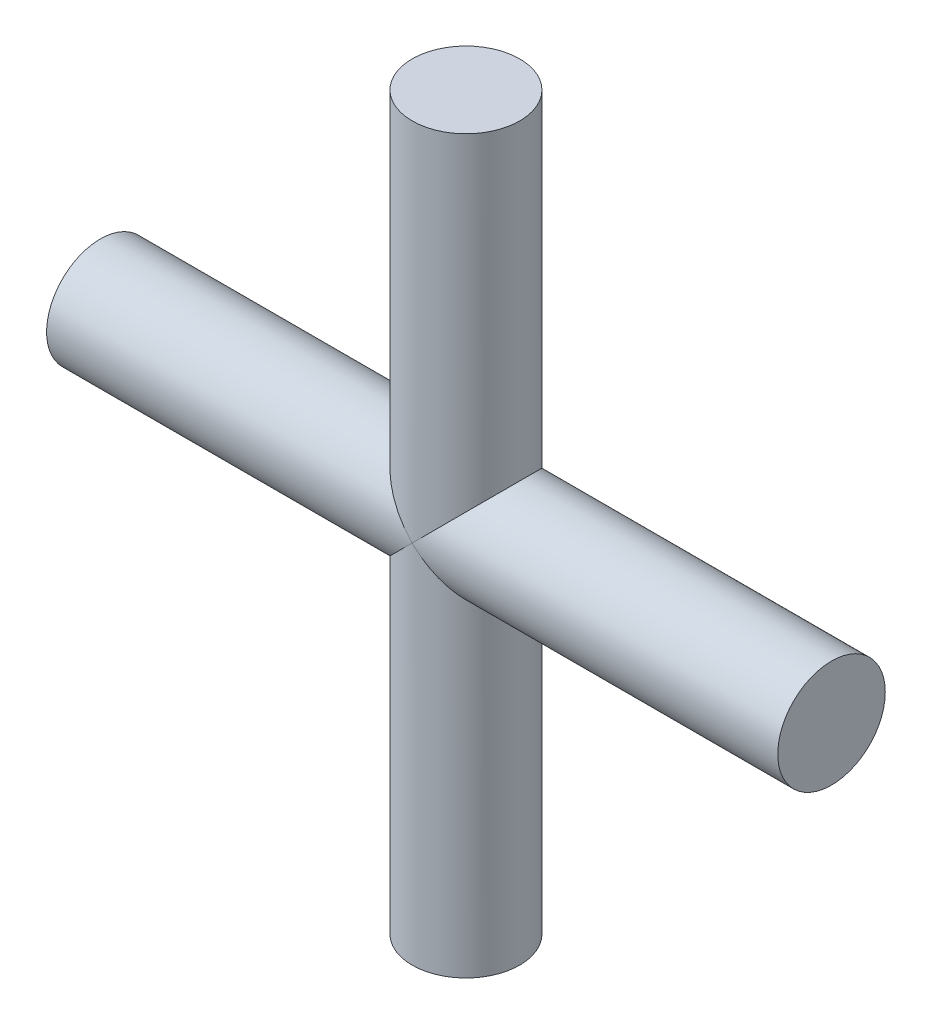
ISO-10303-21;
HEADER;
FILE_DESCRIPTION(('STEP AP214'),'2;1');
FILE_NAME('part.step','',(''),(''),'','','');
FILE_SCHEMA(('AUTOMOTIVE_DESIGN { 1 0 10303 214 1 1 1 1 }'));
ENDSEC;
DATA;
#1=APPLICATION_CONTEXT('core data for automotive mechanical design processes');
#2=APPLICATION_PROTOCOL_DEFINITION('international standard','automotive_design',2000,#1);
#3=PRODUCT_CONTEXT('',#1,'mechanical');
#4=PRODUCT('Part','Part','',(#3));
#5=PRODUCT_RELATED_PRODUCT_CATEGORY('part','',(#4));
#6=PRODUCT_DEFINITION_FORMATION('','',#4);
#7=PRODUCT_DEFINITION_CONTEXT('part definition',#1,'design');
#8=PRODUCT_DEFINITION('design','',#6,#7);
#9=PRODUCT_DEFINITION_SHAPE('','',#8);
#10=(LENGTH_UNIT() NAMED_UNIT(*) SI_UNIT(.MILLI.,.METRE.));
#11=(NAMED_UNIT(*) PLANE_ANGLE_UNIT() SI_UNIT($,.RADIAN.));
#12=(NAMED_UNIT(*) SI_UNIT($,.STERADIAN.) SOLID_ANGLE_UNIT());
#13=UNCERTAINTY_MEASURE_WITH_UNIT(LENGTH_MEASURE(1.E-05),#10,'distance_accuracy_value','');
#14=(GEOMETRIC_REPRESENTATION_CONTEXT(3) GLOBAL_UNCERTAINTY_ASSIGNED_CONTEXT((#13)) GLOBAL_UNIT_ASSIGNED_CONTEXT((#10,
#11,#12)) REPRESENTATION_CONTEXT('',''));
#15=CARTESIAN_POINT('',(0.,0.,0.));
#16=DIRECTION('',(0.,0.,1.));
#17=DIRECTION('',(1.,0.,0.));
#18=AXIS2_PLACEMENT_3D('',#15,#16,#17);
#19=CARTESIAN_POINT('',(0.,34.,0.));
#20=DIRECTION('',(0.,-1.,0.));
#21=DIRECTION('',(0.,0.,-1.));
#22=AXIS2_PLACEMENT_3D('',#19,#20,#21);
#23=CYLINDRICAL_SURFACE('',#22,2.5);
#24=CARTESIAN_POINT('',(0.,34.,0.));
#25=DIRECTION('',(0.,1.,0.));
#26=DIRECTION('',(0.,0.,1.));
#27=AXIS2_PLACEMENT_3D('',#24,#25,#26);
#28=CIRCLE('',#27,2.5);
#29=CARTESIAN_POINT('',(0.,34.,2.5));
#30=VERTEX_POINT('',#29);
#31=EDGE_CURVE('E62',#30,#30,#28,.T.);
#32=ORIENTED_EDGE('',*,*,#31,.F.);
#33=EDGE_LOOP('',(#32));
#34=FACE_BOUND('',#33,.T.);
#35=CARTESIAN_POINT('',(0.,17.,0.));
#36=DIRECTION('',(-0.707106781186547,-0.707106781186547,0.));
#37=DIRECTION('',(0.707106781186547,-0.707106781186547,0.));
#38=AXIS2_PLACEMENT_3D('',#35,#36,#37);
#39=ELLIPSE('',#38,3.53553390593274,2.5);
#40=CARTESIAN_POINT('',(0.,17.,2.5));
#41=VERTEX_POINT('',#40);
#42=CARTESIAN_POINT('',(0.,17.,-2.5));
#43=VERTEX_POINT('',#42);
#44=EDGE_CURVE('E46',#41,#43,#39,.T.);
#45=ORIENTED_EDGE('',*,*,#44,.F.);
#46=CARTESIAN_POINT('',(0.,17.,0.));
#47=DIRECTION('',(0.707106781186547,-0.707106781186547,0.));
#48=DIRECTION('',(-0.707106781186547,-0.707106781186547,0.));
#49=AXIS2_PLACEMENT_3D('',#46,#47,#48);
#50=ELLIPSE('',#49,3.53553390593274,2.5);
#51=EDGE_CURVE('E58',#43,#41,#50,.T.);
#52=ORIENTED_EDGE('',*,*,#51,.F.);
#53=EDGE_LOOP('',(#45,#52));
#54=FACE_BOUND('',#53,.T.);
#55=ADVANCED_FACE('F38',(#34,#54),#23,.T.);
#56=CARTESIAN_POINT('',(0.,34.,0.));
#57=DIRECTION('',(0.,1.,0.));
#58=DIRECTION('',(0.,0.,1.));
#59=AXIS2_PLACEMENT_3D('',#56,#57,#58);
#60=PLANE('',#59);
#61=ORIENTED_EDGE('',*,*,#31,.T.);
#62=EDGE_LOOP('',(#61));
#63=FACE_BOUND('',#62,.T.);
#64=ADVANCED_FACE('F85',(#63),#60,.T.);
#65=CARTESIAN_POINT('',(-17.,17.,0.));
#66=DIRECTION('',(1.,0.,0.));
#67=DIRECTION('',(0.,0.,-1.));
#68=AXIS2_PLACEMENT_3D('',#65,#66,#67);
#69=PLANE('',#68);
#70=CARTESIAN_POINT('',(-17.,17.,0.));
#71=DIRECTION('',(1.,0.,0.));
#72=DIRECTION('',(0.,0.,-1.));
#73=AXIS2_PLACEMENT_3D('',#70,#71,#72);
#74=CIRCLE('',#73,2.5);
#75=CARTESIAN_POINT('',(-17.,17.,-2.5));
#76=VERTEX_POINT('',#75);
#77=EDGE_CURVE('E99',#76,#76,#74,.T.);
#78=ORIENTED_EDGE('',*,*,#77,.F.);
#79=EDGE_LOOP('',(#78));
#80=FACE_BOUND('',#79,.T.);
#81=ADVANCED_FACE('F82',(#80),#69,.F.);
#82=CARTESIAN_POINT('',(17.,17.,0.));
#83=DIRECTION('',(-1.,0.,0.));
#84=DIRECTION('',(0.,0.,1.));
#85=AXIS2_PLACEMENT_3D('',#82,#83,#84);
#86=CYLINDRICAL_SURFACE('',#85,2.5);
#87=ORIENTED_EDGE('',*,*,#77,.T.);
#88=EDGE_LOOP('',(#87));
#89=FACE_BOUND('',#88,.T.);
#90=CARTESIAN_POINT('',(0.,17.,0.));
#91=DIRECTION('',(0.707106781186547,-0.707106781186547,0.));
#92=DIRECTION('',(-0.707106781186547,-0.707106781186547,0.));
#93=AXIS2_PLACEMENT_3D('',#90,#91,#92);
#94=ELLIPSE('',#93,3.53553390593274,2.5);
#95=EDGE_CURVE('E52',#43,#41,#94,.F.);
#96=ORIENTED_EDGE('',*,*,#95,.T.);
#97=ORIENTED_EDGE('',*,*,#44,.T.);
#98=EDGE_LOOP('',(#96,#97));
#99=FACE_BOUND('',#98,.T.);
#100=ADVANCED_FACE('F64',(#89,#99),#86,.T.);
#101=CARTESIAN_POINT('',(0.,0.,0.));
#102=DIRECTION('',(0.,1.,0.));
#103=DIRECTION('',(0.,0.,1.));
#104=AXIS2_PLACEMENT_3D('',#101,#102,#103);
#105=PLANE('',#104);
#106=CARTESIAN_POINT('',(0.,0.,0.));
#107=DIRECTION('',(0.,1.,0.));
#108=DIRECTION('',(0.,0.,1.));
#109=AXIS2_PLACEMENT_3D('',#106,#107,#108);
#110=CIRCLE('',#109,2.5);
#111=CARTESIAN_POINT('',(0.,0.,2.5));
#112=VERTEX_POINT('',#111);
#113=EDGE_CURVE('E93',#112,#112,#110,.T.);
#114=ORIENTED_EDGE('',*,*,#113,.F.);
#115=EDGE_LOOP('',(#114));
#116=FACE_BOUND('',#115,.T.);
#117=ADVANCED_FACE('F76',(#116),#105,.F.);
#118=ORIENTED_EDGE('',*,*,#113,.T.);
#119=EDGE_LOOP('',(#118));
#120=FACE_BOUND('',#119,.T.);
#121=CARTESIAN_POINT('',(0.,17.,0.));
#122=DIRECTION('',(-0.707106781186547,-0.707106781186547,0.));
#123=DIRECTION('',(0.707106781186547,-0.707106781186547,0.));
#124=AXIS2_PLACEMENT_3D('',#121,#122,#123);
#125=ELLIPSE('',#124,3.53553390593274,2.5);
#126=EDGE_CURVE('E11',#41,#43,#125,.F.);
#127=ORIENTED_EDGE('',*,*,#126,.F.);
#128=ORIENTED_EDGE('',*,*,#95,.F.);
#129=EDGE_LOOP('',(#127,#128));
#130=FACE_BOUND('',#129,.T.);
#131=ADVANCED_FACE('F40',(#120,#130),#23,.T.);
#132=CARTESIAN_POINT('',(17.,17.,0.));
#133=DIRECTION('',(1.,0.,0.));
#134=DIRECTION('',(0.,0.,-1.));
#135=AXIS2_PLACEMENT_3D('',#132,#133,#134);
#136=CIRCLE('',#135,2.5);
#137=CARTESIAN_POINT('',(17.,17.,-2.5));
#138=VERTEX_POINT('',#137);
#139=EDGE_CURVE('E96',#138,#138,#136,.T.);
#140=ORIENTED_EDGE('',*,*,#139,.F.);
#141=EDGE_LOOP('',(#140));
#142=FACE_BOUND('',#141,.T.);
#143=ORIENTED_EDGE('',*,*,#51,.T.);
#144=ORIENTED_EDGE('',*,*,#126,.T.);
#145=EDGE_LOOP('',(#143,#144));
#146=FACE_BOUND('',#145,.T.);
#147=ADVANCED_FACE('F65',(#142,#146),#86,.T.);
#148=CARTESIAN_POINT('',(17.,17.,0.));
#149=DIRECTION('',(1.,0.,0.));
#150=DIRECTION('',(0.,0.,-1.));
#151=AXIS2_PLACEMENT_3D('',#148,#149,#150);
#152=PLANE('',#151);
#153=ORIENTED_EDGE('',*,*,#139,.T.);
#154=EDGE_LOOP('',(#153));
#155=FACE_BOUND('',#154,.T.);
#156=ADVANCED_FACE('F67',(#155),#152,.T.);
#157=CLOSED_SHELL('',(#55,#64,#81,#100,#117,#131,#147,#156));
#158=MANIFOLD_SOLID_BREP('B2',#157);
#159=ADVANCED_BREP_SHAPE_REPRESENTATION('',(#18,#158),#14);
#160=SHAPE_DEFINITION_REPRESENTATION(#9,#159);
ENDSEC;
END-ISO-10303-21;
